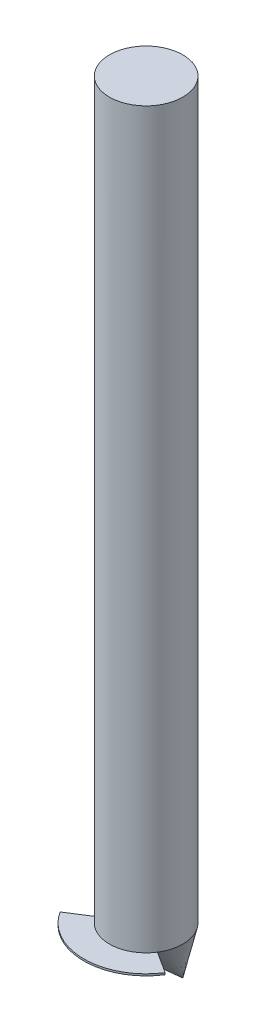
ISO-10303-21;
HEADER;
FILE_DESCRIPTION(('STEP AP214'),'2;1');
FILE_NAME('part.step','',(''),(''),'','','');
FILE_SCHEMA(('AUTOMOTIVE_DESIGN { 1 0 10303 214 1 1 1 1 }'));
ENDSEC;
DATA;
#1=APPLICATION_CONTEXT('core data for automotive mechanical design processes');
#2=APPLICATION_PROTOCOL_DEFINITION('international standard','automotive_design',2000,#1);
#3=PRODUCT_CONTEXT('',#1,'mechanical');
#4=PRODUCT('Part','Part','',(#3));
#5=PRODUCT_RELATED_PRODUCT_CATEGORY('part','',(#4));
#6=PRODUCT_DEFINITION_FORMATION('','',#4);
#7=PRODUCT_DEFINITION_CONTEXT('part definition',#1,'design');
#8=PRODUCT_DEFINITION('design','',#6,#7);
#9=PRODUCT_DEFINITION_SHAPE('','',#8);
#10=(LENGTH_UNIT() NAMED_UNIT(*) SI_UNIT(.MILLI.,.METRE.));
#11=(NAMED_UNIT(*) PLANE_ANGLE_UNIT() SI_UNIT($,.RADIAN.));
#12=(NAMED_UNIT(*) SI_UNIT($,.STERADIAN.) SOLID_ANGLE_UNIT());
#13=UNCERTAINTY_MEASURE_WITH_UNIT(LENGTH_MEASURE(1.E-05),#10,'distance_accuracy_value','');
#14=(GEOMETRIC_REPRESENTATION_CONTEXT(3) GLOBAL_UNCERTAINTY_ASSIGNED_CONTEXT((#13)) GLOBAL_UNIT_ASSIGNED_CONTEXT((#10,
#11,#12)) REPRESENTATION_CONTEXT('',''));
#15=CARTESIAN_POINT('',(0.,0.,0.));
#16=DIRECTION('',(0.,0.,1.));
#17=DIRECTION('',(1.,0.,0.));
#18=AXIS2_PLACEMENT_3D('',#15,#16,#17);
#19=CARTESIAN_POINT('',(0.,0.,0.));
#20=DIRECTION('',(0.,-1.,0.));
#21=DIRECTION('',(0.,0.,-1.));
#22=AXIS2_PLACEMENT_3D('',#19,#20,#21);
#23=PLANE('',#22);
#24=CARTESIAN_POINT('',(0.,0.,0.));
#25=DIRECTION('',(0.,1.,0.));
#26=DIRECTION('',(0.,0.,1.));
#27=AXIS2_PLACEMENT_3D('',#24,#25,#26);
#28=CIRCLE('',#27,5.);
#29=CARTESIAN_POINT('',(-4.21695722906443,0.,2.68649804173411));
#30=VERTEX_POINT('',#29);
#31=CARTESIAN_POINT('',(4.21696325108084,0.,2.68650190709249));
#32=VERTEX_POINT('',#31);
#33=EDGE_CURVE('E12',#30,#32,#28,.T.);
#34=ORIENTED_EDGE('',*,*,#33,.F.);
#35=DIRECTION('',(-0.843391445812887,0.,0.537299608346822));
#36=VECTOR('',#35,1.);
#37=CARTESIAN_POINT('',(0.,0.,0.));
#38=LINE('',#37,#36);
#39=CARTESIAN_POINT('',(-7.16882728940954,0.,4.56704667094799));
#40=VERTEX_POINT('',#39);
#41=EDGE_CURVE('E185',#30,#40,#38,.T.);
#42=ORIENTED_EDGE('',*,*,#41,.T.);
#43=CARTESIAN_POINT('',(0.,0.,0.));
#44=DIRECTION('',(0.,-1.,0.));
#45=DIRECTION('',(0.,0.,-1.));
#46=AXIS2_PLACEMENT_3D('',#43,#44,#45);
#47=CIRCLE('',#46,8.5);
#48=CARTESIAN_POINT('',(7.16882728940954,0.,4.56704667094799));
#49=VERTEX_POINT('',#48);
#50=EDGE_CURVE('E64',#49,#40,#47,.T.);
#51=ORIENTED_EDGE('',*,*,#50,.F.);
#52=DIRECTION('',(0.843391445812887,0.,0.537299608346822));
#53=VECTOR('',#52,1.);
#54=CARTESIAN_POINT('',(0.,0.,0.));
#55=LINE('',#54,#53);
#56=EDGE_CURVE('E166',#32,#49,#55,.T.);
#57=ORIENTED_EDGE('',*,*,#56,.F.);
#58=EDGE_LOOP('',(#34,#42,#51,#57));
#59=FACE_BOUND('',#58,.T.);
#60=ADVANCED_FACE('F53',(#59),#23,.F.);
#61=CARTESIAN_POINT('',(0.,0.,0.));
#62=DIRECTION('',(0.,-1.,0.));
#63=DIRECTION('',(0.,0.,-1.));
#64=AXIS2_PLACEMENT_3D('',#61,#62,#63);
#65=CYLINDRICAL_SURFACE('',#64,8.5);
#66=CARTESIAN_POINT('',(0.,-0.250000000000001,0.));
#67=DIRECTION('',(0.,-1.,0.));
#68=DIRECTION('',(0.,0.,-1.));
#69=AXIS2_PLACEMENT_3D('',#66,#67,#68);
#70=CIRCLE('',#69,8.5);
#71=CARTESIAN_POINT('',(7.16882728940954,-0.250000000000001,4.56704667094799));
#72=VERTEX_POINT('',#71);
#73=CARTESIAN_POINT('',(-7.16882728940954,-0.250000000000001,4.56704667094799));
#74=VERTEX_POINT('',#73);
#75=EDGE_CURVE('E213',#72,#74,#70,.T.);
#76=ORIENTED_EDGE('',*,*,#75,.F.);
#77=DIRECTION('',(0.,-1.,0.));
#78=VECTOR('',#77,1.);
#79=CARTESIAN_POINT('',(7.16882728940954,0.,4.56704667094799));
#80=LINE('',#79,#78);
#81=EDGE_CURVE('E174',#49,#72,#80,.T.);
#82=ORIENTED_EDGE('',*,*,#81,.F.);
#83=ORIENTED_EDGE('',*,*,#50,.T.);
#84=DIRECTION('',(0.,-1.,0.));
#85=VECTOR('',#84,1.);
#86=CARTESIAN_POINT('',(-7.16882728940954,0.,4.56704667094799));
#87=LINE('',#86,#85);
#88=EDGE_CURVE('E167',#40,#74,#87,.T.);
#89=ORIENTED_EDGE('',*,*,#88,.T.);
#90=EDGE_LOOP('',(#76,#82,#83,#89));
#91=FACE_BOUND('',#90,.T.);
#92=ADVANCED_FACE('F55',(#91),#65,.T.);
#93=CARTESIAN_POINT('',(0.,-4.5,0.));
#94=DIRECTION('',(0.,1.,0.));
#95=DIRECTION('',(0.,0.,1.));
#96=AXIS2_PLACEMENT_3D('',#93,#94,#95);
#97=CONICAL_SURFACE('',#96,0.,1.10714871779409);
#98=CARTESIAN_POINT('',(0.115010179875413,-4.43181684468914,0.0732695652887457));
#99=CARTESIAN_POINT('',(0.0955702027556307,-4.44317958346797,0.0614832766915166));
#100=CARTESIAN_POINT('',(0.0762660325394554,-4.45454288246637,0.0494843352852782));
#101=CARTESIAN_POINT('',(0.0379293059143179,-4.47727060090231,0.0250611468547828));
#102=CARTESIAN_POINT('',(0.0188967495053557,-4.48863502033985,0.0126368998305258));
#103=CARTESIAN_POINT('',(0.,-4.49999999999696,-2.74053783139161E-12));
#104=B_SPLINE_CURVE_WITH_KNOTS('',3,(#98,#99,#100,#101,#102,#103),.UNSPECIFIED.,.F.,.F.,(4,2,4),
(0.,0.0762348432187777,0.152469686437555),.UNSPECIFIED.);
#105=CARTESIAN_POINT('',(0.115010179875413,-4.43181684468914,0.0732695652887457));
#106=VERTEX_POINT('',#105);
#107=CARTESIAN_POINT('',(0.,-4.49999999998898,0.));
#108=VERTEX_POINT('',#107);
#109=EDGE_CURVE('E196',#106,#108,#104,.T.);
#110=ORIENTED_EDGE('',*,*,#109,.F.);
#111=DIRECTION('',(0.754352241791778,0.447213595499958,0.480575379419003));
#112=VECTOR('',#111,1.);
#113=CARTESIAN_POINT('',(1.5181046024632,-3.6,0.96713929502428));
#114=LINE('',#113,#112);
#115=EDGE_CURVE('E80',#106,#72,#114,.T.);
#116=ORIENTED_EDGE('',*,*,#115,.T.);
#117=ORIENTED_EDGE('',*,*,#75,.T.);
#118=DIRECTION('',(-0.754352241791778,0.447213595499958,0.480575379419003));
#119=VECTOR('',#118,1.);
#120=CARTESIAN_POINT('',(-1.5181046024632,-3.6,0.96713929502428));
#121=LINE('',#120,#119);
#122=CARTESIAN_POINT('',(-0.115010179875397,-4.43181684468915,0.073269565288735));
#123=VERTEX_POINT('',#122);
#124=EDGE_CURVE('E157',#123,#74,#121,.T.);
#125=ORIENTED_EDGE('',*,*,#124,.F.);
#126=CARTESIAN_POINT('',(-0.115010179875343,-4.43181684468919,0.0732695652887012));
#127=CARTESIAN_POINT('',(-0.0955702027555733,-4.44317958346801,0.0614832766914791));
#128=CARTESIAN_POINT('',(-0.0762660325394097,-4.4545428824664,0.049484335285248));
#129=CARTESIAN_POINT('',(-0.0379293059142952,-4.47727060090232,0.0250611468547674));
#130=CARTESIAN_POINT('',(-0.0188967495053444,-4.48863502033985,0.012636899830518));
#131=CARTESIAN_POINT('',(0.,-4.49999999999696,-2.74053783139161E-12));
#132=B_SPLINE_CURVE_WITH_KNOTS('',3,(#126,#127,#128,#129,#130,#131),.UNSPECIFIED.,.F.,.F.,(4,2,
4),(0.,0.076234843218732,0.152469686437463),.UNSPECIFIED.);
#133=EDGE_CURVE('E57',#108,#123,#132,.F.);
#134=ORIENTED_EDGE('',*,*,#133,.F.);
#135=EDGE_LOOP('',(#110,#116,#117,#125,#134));
#136=FACE_BOUND('',#135,.T.);
#137=ADVANCED_FACE('F124',(#136),#97,.T.);
#138=CARTESIAN_POINT('',(0.,0.,0.));
#139=DIRECTION('',(0.537299608346822,0.,-0.843391445812887));
#140=DIRECTION('',(-0.843391445812887,0.,-0.537299608346822));
#141=AXIS2_PLACEMENT_3D('',#138,#139,#140);
#142=PLANE('',#141);
#143=CARTESIAN_POINT('',(4.21695464372675,0.,2.68649639469236));
#144=CARTESIAN_POINT('',(4.13529598131993,-0.113362311672921,2.63447408933566));
#145=CARTESIAN_POINT('',(4.05322897952794,-0.22631300640358,2.58219164310034));
#146=CARTESIAN_POINT('',(3.8881825550377,-0.451304027508447,2.477045474405));
#147=CARTESIAN_POINT('',(3.80520299163304,-0.563344208726185,2.4241816623051));
#148=CARTESIAN_POINT('',(3.63825699057637,-0.786397157383103,2.31782532987116));
#149=CARTESIAN_POINT('',(3.55429050342816,-0.897409872789431,2.26433277800456));
#150=CARTESIAN_POINT('',(3.38482881952689,-1.11886008354666,2.1563737788447));
#151=CARTESIAN_POINT('',(3.29932787490589,-1.22929140000243,2.10190366975572));
#152=CARTESIAN_POINT('',(3.12712690414394,-1.44882508552312,1.9921995524011));
#153=CARTESIAN_POINT('',(3.04042692528829,-1.55792750667722,1.93696557425953));
#154=CARTESIAN_POINT('',(2.86569623854587,-1.77462393018895,1.82564985008546));
#155=CARTESIAN_POINT('',(2.77766553870195,-1.8822179416558,1.76956810917683));
#156=CARTESIAN_POINT('',(2.58926961889569,-2.10874306167403,1.64954667141079));
#157=CARTESIAN_POINT('',(2.48871295284673,-2.22745078792119,1.58548500994503));
#158=CARTESIAN_POINT('',(2.28548704113904,-2.46229511100159,1.4560158253706));
#159=CARTESIAN_POINT('',(2.18281785873475,-2.57843178460355,1.39060834255944));
#160=CARTESIAN_POINT('',(1.97530512805198,-2.80732032925812,1.25840815310241));
#161=CARTESIAN_POINT('',(1.87046768240539,-2.92007996256261,1.19161933426182));
#162=CARTESIAN_POINT('',(1.65806041764115,-3.14190869449309,1.05630098270138));
#163=CARTESIAN_POINT('',(1.55049093096159,-3.25097823840273,0.98777166176794));
#164=CARTESIAN_POINT('',(1.3670415254597,-3.43034244540092,0.870901501159707));
#165=CARTESIAN_POINT('',(1.29202836490579,-3.50188277502742,0.823112847401323));
#166=CARTESIAN_POINT('',(1.14036820372748,-3.64245974180417,0.726494668965118));
#167=CARTESIAN_POINT('',(1.06372147959544,-3.71149679739131,0.677665320432369));
#168=CARTESIAN_POINT('',(0.908642316753047,-3.84660691703344,0.578868997714616));
#169=CARTESIAN_POINT('',(0.830210819771741,-3.91268149196005,0.528902623477189));
#170=CARTESIAN_POINT('',(0.71080105481019,-4.00929157045482,0.452830213370164));
#171=CARTESIAN_POINT('',(0.67058962162996,-4.04116317110716,0.427212705146594));
#172=CARTESIAN_POINT('',(0.589639526772942,-4.10395476914346,0.375641807103644));
#173=CARTESIAN_POINT('',(0.548900853638491,-4.1348747457978,0.349688409984928));
#174=CARTESIAN_POINT('',(0.466840968728141,-4.19566640649007,0.297410497703258));
#175=CARTESIAN_POINT('',(0.425519469936641,-4.22553754682437,0.271085799691201));
#176=CARTESIAN_POINT('',(0.342266091629463,-4.2840547448849,0.218047548259942));
#177=CARTESIAN_POINT('',(0.300334249887229,-4.31270087799698,0.191334018905079));
#178=CARTESIAN_POINT('',(0.215725877275684,-4.36867365252226,0.137432540898944));
#179=CARTESIAN_POINT('',(0.173047907441461,-4.39599724311392,0.110243675525922));
#180=CARTESIAN_POINT('',(0.0870240078954488,-4.44914975994354,0.0554404074064665));
#181=CARTESIAN_POINT('',(0.0436779392865701,-4.47497836992081,0.0278259161728282));
#182=CARTESIAN_POINT('',(0.,-4.49999999998898,0.));
#183=B_SPLINE_CURVE_WITH_KNOTS('',3,(#143,#144,#145,#146,#147,#148,#149,#150,#151,#152,#153,
#154,#155,#156,#157,#158,#159,#160,#161,#162,#163,#164,#165,#166,#167,#168,#169,#170,#171,#172,
#173,#174,#175,#176,#177,#178,#179,#180,#181,#182),.UNSPECIFIED.,.F.,.F.,(4,2,2,2,2,2,2,2,2,2,2,
2,2,2,2,2,2,2,2,4),(0.,0.447247075529468,0.894564106166201,1.34190366719719,1.79161716043059,
2.24131296898443,2.69100606067202,3.19571445692332,3.70040776277318,4.20383463604227,
4.7072005424557,5.04959367760109,5.3919293133861,5.7340883236835,5.90612841205311,
6.07817224539365,6.25030398552431,6.42242511753058,6.59492602235503,6.76746328708282),.UNSPECIFIED.);
#184=EDGE_CURVE('E257',#32,#106,#183,.T.);
#185=ORIENTED_EDGE('',*,*,#184,.F.);
#186=ORIENTED_EDGE('',*,*,#56,.T.);
#187=ORIENTED_EDGE('',*,*,#81,.T.);
#188=ORIENTED_EDGE('',*,*,#115,.F.);
#189=EDGE_LOOP('',(#185,#186,#187,#188));
#190=FACE_BOUND('',#189,.T.);
#191=ADVANCED_FACE('F127',(#190),#142,.T.);
#192=CARTESIAN_POINT('',(0.,0.,0.));
#193=DIRECTION('',(0.537299608346822,0.,0.843391445812887));
#194=DIRECTION('',(0.843391445812887,0.,-0.537299608346822));
#195=AXIS2_PLACEMENT_3D('',#192,#193,#194);
#196=PLANE('',#195);
#197=ORIENTED_EDGE('',*,*,#41,.F.);
#198=CARTESIAN_POINT('',(-4.21695464372675,0.,2.68649639469236));
#199=CARTESIAN_POINT('',(-4.13529598131993,-0.113362311672921,2.63447408933566));
#200=CARTESIAN_POINT('',(-4.05322897952794,-0.226313006403581,2.58219164310034));
#201=CARTESIAN_POINT('',(-3.8881825550377,-0.451304027508452,2.477045474405));
#202=CARTESIAN_POINT('',(-3.80520299163304,-0.563344208726191,2.4241816623051));
#203=CARTESIAN_POINT('',(-3.63825699057637,-0.786397157383113,2.31782532987116));
#204=CARTESIAN_POINT('',(-3.55429050342815,-0.897409872789442,2.26433277800456));
#205=CARTESIAN_POINT('',(-3.38482881952688,-1.11886008354667,2.1563737788447));
#206=CARTESIAN_POINT('',(-3.29932787490587,-1.22929140000245,2.10190366975571));
#207=CARTESIAN_POINT('',(-3.12712690414393,-1.44882508552314,1.99219955240109));
#208=CARTESIAN_POINT('',(-3.04042692528828,-1.55792750667724,1.93696557425952));
#209=CARTESIAN_POINT('',(-2.86569623854586,-1.77462393018897,1.82564985008545));
#210=CARTESIAN_POINT('',(-2.77766553870193,-1.88221794165583,1.76956810917682));
#211=CARTESIAN_POINT('',(-2.58926961889567,-2.10874306167406,1.64954667141077));
#212=CARTESIAN_POINT('',(-2.48871295284671,-2.22745078792121,1.58548500994502));
#213=CARTESIAN_POINT('',(-2.28548704113902,-2.46229511100161,1.45601582537059));
#214=CARTESIAN_POINT('',(-2.18281785873473,-2.57843178460357,1.39060834255942));
#215=CARTESIAN_POINT('',(-1.97530512805197,-2.80732032925813,1.2584081531024));
#216=CARTESIAN_POINT('',(-1.87046768240538,-2.92007996256263,1.19161933426182));
#217=CARTESIAN_POINT('',(-1.65806041764114,-3.14190869449311,1.05630098270137));
#218=CARTESIAN_POINT('',(-1.55049093096158,-3.25097823840274,0.987771661767932));
#219=CARTESIAN_POINT('',(-1.36704152545969,-3.43034244540093,0.8709015011597));
#220=CARTESIAN_POINT('',(-1.29202836490578,-3.50188277502742,0.823112847401317));
#221=CARTESIAN_POINT('',(-1.14036820372747,-3.64245974180418,0.726494668965113));
#222=CARTESIAN_POINT('',(-1.06372147959544,-3.71149679739132,0.677665320432364));
#223=CARTESIAN_POINT('',(-0.90864231675304,-3.84660691703344,0.578868997714611));
#224=CARTESIAN_POINT('',(-0.830210819771735,-3.91268149196006,0.528902623477185));
#225=CARTESIAN_POINT('',(-0.710801054810185,-4.00929157045482,0.452830213370161));
#226=CARTESIAN_POINT('',(-0.670589621629956,-4.04116317110717,0.427212705146591));
#227=CARTESIAN_POINT('',(-0.589639526772938,-4.10395476914346,0.375641807103641));
#228=CARTESIAN_POINT('',(-0.548900853638488,-4.1348747457978,0.349688409984925));
#229=CARTESIAN_POINT('',(-0.466840968728138,-4.19566640649007,0.297410497703256));
#230=CARTESIAN_POINT('',(-0.425519469936638,-4.22553754682438,0.271085799691199));
#231=CARTESIAN_POINT('',(-0.34226609162946,-4.2840547448849,0.21804754825994));
#232=CARTESIAN_POINT('',(-0.300334249887227,-4.31270087799699,0.191334018905078));
#233=CARTESIAN_POINT('',(-0.215725877275682,-4.36867365252226,0.137432540898943));
#234=CARTESIAN_POINT('',(-0.173047907441459,-4.39599724311392,0.110243675525921));
#235=CARTESIAN_POINT('',(-0.0870240078954479,-4.44914975994354,0.0554404074064659));
#236=CARTESIAN_POINT('',(-0.0436779392865695,-4.47497836992081,0.0278259161728278));
#237=CARTESIAN_POINT('',(0.,-4.49999999998898,0.));
#238=B_SPLINE_CURVE_WITH_KNOTS('',3,(#198,#199,#200,#201,#202,#203,#204,#205,#206,#207,#208,
#209,#210,#211,#212,#213,#214,#215,#216,#217,#218,#219,#220,#221,#222,#223,#224,#225,#226,#227,
#228,#229,#230,#231,#232,#233,#234,#235,#236,#237),.UNSPECIFIED.,.F.,.F.,(4,2,2,2,2,2,2,2,2,2,2,
2,2,2,2,2,2,2,2,4),(0.,0.447247075529473,0.894564106166213,1.34190366719721,1.79161716043061,
2.24131296898446,2.69100606067206,3.19571445692335,3.7004077627732,4.20383463604229,
4.70720054245571,5.0495936776011,5.39192931338611,5.7340883236835,5.90612841205312,
6.07817224539365,6.25030398552431,6.42242511753058,6.59492602235503,6.76746328708282),.UNSPECIFIED.);
#239=EDGE_CURVE('E72',#30,#123,#238,.T.);
#240=ORIENTED_EDGE('',*,*,#239,.T.);
#241=ORIENTED_EDGE('',*,*,#124,.T.);
#242=ORIENTED_EDGE('',*,*,#88,.F.);
#243=EDGE_LOOP('',(#197,#240,#241,#242));
#244=FACE_BOUND('',#243,.T.);
#245=ADVANCED_FACE('F208',(#244),#196,.F.);
#246=CARTESIAN_POINT('',(0.,100.,0.));
#247=DIRECTION('',(0.,-1.,0.));
#248=DIRECTION('',(0.,0.,-1.));
#249=AXIS2_PLACEMENT_3D('',#246,#247,#248);
#250=CYLINDRICAL_SURFACE('',#249,5.);
#251=CARTESIAN_POINT('',(0.,100.,0.));
#252=DIRECTION('',(0.,1.,0.));
#253=DIRECTION('',(0.,0.,1.));
#254=AXIS2_PLACEMENT_3D('',#251,#252,#253);
#255=CIRCLE('',#254,5.);
#256=CARTESIAN_POINT('',(0.,100.,5.));
#257=VERTEX_POINT('',#256);
#258=EDGE_CURVE('E181',#257,#257,#255,.T.);
#259=ORIENTED_EDGE('',*,*,#258,.F.);
#260=EDGE_LOOP('',(#259));
#261=FACE_BOUND('',#260,.T.);
#262=CARTESIAN_POINT('',(0.,0.,5.));
#263=CARTESIAN_POINT('',(-0.326978984574362,0.,5.));
#264=CARTESIAN_POINT('',(-0.704611122936241,0.,4.97038895966088));
#265=CARTESIAN_POINT('',(-1.35974664688627,0.,4.81678314516054));
#266=CARTESIAN_POINT('',(-1.59277804522613,0.,4.74690177037475));
#267=CARTESIAN_POINT('',(-2.08490842149666,0.,4.55227143225375));
#268=CARTESIAN_POINT('',(-2.34418413499809,0.,4.42746620441345));
#269=CARTESIAN_POINT('',(-2.87722129558654,0.,4.10112836500192));
#270=CARTESIAN_POINT('',(-3.15118763253575,0.,3.89937128936302));
#271=CARTESIAN_POINT('',(-3.68749474470446,0.,3.39668403822491));
#272=CARTESIAN_POINT('',(-3.94989673329104,0.,3.09526722548789));
#273=CARTESIAN_POINT('',(-4.41758137591639,0.,2.38061718636143));
#274=CARTESIAN_POINT('',(-4.6224402239894,0.,1.96675194442517));
#275=CARTESIAN_POINT('',(-4.91419196510363,0.,1.04200967623448));
#276=CARTESIAN_POINT('',(-5.,0.,0.530954952157263));
#277=CARTESIAN_POINT('',(-5.,0.,-0.530954952157263));
#278=CARTESIAN_POINT('',(-4.91419196510363,0.,-1.04200967623448));
#279=CARTESIAN_POINT('',(-4.6224402239894,0.,-1.96675194442517));
#280=CARTESIAN_POINT('',(-4.41758137591639,0.,-2.38061718636143));
#281=CARTESIAN_POINT('',(-3.94989673329104,0.,-3.09526722548789));
#282=CARTESIAN_POINT('',(-3.68749474470446,0.,-3.39668403822491));
#283=CARTESIAN_POINT('',(-3.15118763253575,0.,-3.89937128936302));
#284=CARTESIAN_POINT('',(-2.87722129558654,0.,-4.10112836500192));
#285=CARTESIAN_POINT('',(-2.34418413499809,0.,-4.42746620441345));
#286=CARTESIAN_POINT('',(-2.08490842149666,0.,-4.55227143225375));
#287=CARTESIAN_POINT('',(-1.59277804522613,0.,-4.74690177037475));
#288=CARTESIAN_POINT('',(-1.35974664688627,0.,-4.81678314516054));
#289=CARTESIAN_POINT('',(-0.704611122936241,0.,-4.97038895966089));
#290=CARTESIAN_POINT('',(-0.326978984574363,0.,-5.));
#291=CARTESIAN_POINT('',(0.326978984574363,0.,-5.));
#292=CARTESIAN_POINT('',(0.704611122936243,0.,-4.97038895966088));
#293=CARTESIAN_POINT('',(1.35974664688627,0.,-4.81678314516054));
#294=CARTESIAN_POINT('',(1.59277804522613,0.,-4.74690177037475));
#295=CARTESIAN_POINT('',(2.08490842149666,0.,-4.55227143225375));
#296=CARTESIAN_POINT('',(2.34418413499808,0.,-4.42746620441345));
#297=CARTESIAN_POINT('',(2.87722129558655,0.,-4.10112836500191));
#298=CARTESIAN_POINT('',(3.15118763253575,0.,-3.89937128936302));
#299=CARTESIAN_POINT('',(3.68749474470446,0.,-3.39668403822491));
#300=CARTESIAN_POINT('',(3.94989673329104,0.,-3.09526722548789));
#301=CARTESIAN_POINT('',(4.41758137591639,0.,-2.38061718636143));
#302=CARTESIAN_POINT('',(4.6224402239894,0.,-1.96675194442517));
#303=CARTESIAN_POINT('',(4.91419196510363,0.,-1.04200967623448));
#304=CARTESIAN_POINT('',(5.,0.,-0.530954952157262));
#305=CARTESIAN_POINT('',(5.,0.,0.530954952157264));
#306=CARTESIAN_POINT('',(4.91419196510363,0.,1.04200967623448));
#307=CARTESIAN_POINT('',(4.6224402239894,0.,1.96675194442517));
#308=CARTESIAN_POINT('',(4.41758137591639,0.,2.38061718636143));
#309=CARTESIAN_POINT('',(3.94989673329104,0.,3.09526722548789));
#310=CARTESIAN_POINT('',(3.68749474470446,0.,3.39668403822491));
#311=CARTESIAN_POINT('',(3.15118763253575,0.,3.89937128936302));
#312=CARTESIAN_POINT('',(2.87722129558655,0.,4.10112836500192));
#313=CARTESIAN_POINT('',(2.34418413499808,0.,4.42746620441346));
#314=CARTESIAN_POINT('',(2.08490842149666,0.,4.55227143225375));
#315=CARTESIAN_POINT('',(1.59277804522613,0.,4.74690177037475));
#316=CARTESIAN_POINT('',(1.35974664688627,0.,4.81678314516054));
#317=CARTESIAN_POINT('',(0.704611122936242,0.,4.97038895966088));
#318=CARTESIAN_POINT('',(0.326978984574362,0.,5.));
#319=CARTESIAN_POINT('',(0.,0.,5.));
#320=B_SPLINE_CURVE_WITH_KNOTS('',3,(#262,#263,#264,#265,#266,#267,#268,#269,#270,#271,#272,
#273,#274,#275,#276,#277,#278,#279,#280,#281,#282,#283,#284,#285,#286,#287,#288,#289,#290,#291,
#292,#293,#294,#295,#296,#297,#298,#299,#300,#301,#302,#303,#304,#305,#306,#307,#308,#309,#310,
#311,#312,#313,#314,#315,#316,#317,#318,#319),.UNSPECIFIED.,.T.,.F.,(4,2,2,2,2,2,2,2,2,2,2,2,2,
2,2,2,2,2,2,2,2,2,2,2,2,2,2,2,4),(0.,0.0624999999999998,0.0937499999999998,0.125,0.15625,0.1875,
0.21875,0.25,0.28125,0.3125,0.34375,0.375,0.40625,0.4375,0.5,0.5625,0.59375,0.625,0.65625,
0.6875,0.71875,0.75,0.78125,0.8125,0.84375,0.875,0.90625,0.9375,1.),.UNSPECIFIED.);
#321=EDGE_CURVE('E186',#32,#30,#320,.F.);
#322=ORIENTED_EDGE('',*,*,#321,.T.);
#323=ORIENTED_EDGE('',*,*,#33,.T.);
#324=EDGE_LOOP('',(#322,#323));
#325=FACE_BOUND('',#324,.T.);
#326=ADVANCED_FACE('F111',(#261,#325),#250,.T.);
#327=CARTESIAN_POINT('',(0.,100.,0.));
#328=DIRECTION('',(0.,1.,0.));
#329=DIRECTION('',(0.,0.,1.));
#330=AXIS2_PLACEMENT_3D('',#327,#328,#329);
#331=PLANE('',#330);
#332=ORIENTED_EDGE('',*,*,#258,.T.);
#333=EDGE_LOOP('',(#332));
#334=FACE_BOUND('',#333,.T.);
#335=ADVANCED_FACE('F106',(#334),#331,.T.);
#336=CARTESIAN_POINT('',(0.,-9.,-5.00000000002449));
#337=CARTESIAN_POINT('',(0.,0.,5.));
#338=CARTESIAN_POINT('',(0.,-9.,-5.00000000002449));
#339=CARTESIAN_POINT('',(0.326978984574362,0.,5.));
#340=CARTESIAN_POINT('',(0.,-9.,-5.00000000002449));
#341=CARTESIAN_POINT('',(0.704611122936242,0.,4.97038895966088));
#342=CARTESIAN_POINT('',(0.,-9.,-5.00000000002449));
#343=CARTESIAN_POINT('',(1.35974664688627,0.,4.81678314516054));
#344=CARTESIAN_POINT('',(0.,-9.,-5.00000000002449));
#345=CARTESIAN_POINT('',(1.59277804522613,0.,4.74690177037475));
#346=CARTESIAN_POINT('',(0.,-9.,-5.00000000002449));
#347=CARTESIAN_POINT('',(2.08490842149666,0.,4.55227143225375));
#348=CARTESIAN_POINT('',(0.,-9.,-5.00000000002449));
#349=CARTESIAN_POINT('',(2.34418413499808,0.,4.42746620441346));
#350=CARTESIAN_POINT('',(0.,-9.,-5.00000000002449));
#351=CARTESIAN_POINT('',(2.87722129558655,0.,4.10112836500192));
#352=CARTESIAN_POINT('',(0.,-9.,-5.00000000002449));
#353=CARTESIAN_POINT('',(3.15118763253575,0.,3.89937128936302));
#354=CARTESIAN_POINT('',(0.,-9.,-5.00000000002449));
#355=CARTESIAN_POINT('',(3.68749474470446,0.,3.39668403822491));
#356=CARTESIAN_POINT('',(0.,-9.,-5.00000000002449));
#357=CARTESIAN_POINT('',(3.94989673329104,0.,3.09526722548789));
#358=CARTESIAN_POINT('',(0.,-9.,-5.00000000002449));
#359=CARTESIAN_POINT('',(4.41758137591639,0.,2.38061718636143));
#360=CARTESIAN_POINT('',(0.,-9.,-5.00000000002449));
#361=CARTESIAN_POINT('',(4.6224402239894,0.,1.96675194442517));
#362=CARTESIAN_POINT('',(0.,-9.,-5.00000000002449));
#363=CARTESIAN_POINT('',(4.91419196510363,0.,1.04200967623448));
#364=CARTESIAN_POINT('',(0.,-9.,-5.00000000002449));
#365=CARTESIAN_POINT('',(5.,0.,0.530954952157264));
#366=CARTESIAN_POINT('',(0.,-9.,-5.00000000002449));
#367=CARTESIAN_POINT('',(5.,0.,-0.530954952157262));
#368=CARTESIAN_POINT('',(0.,-9.,-5.00000000002449));
#369=CARTESIAN_POINT('',(4.91419196510363,0.,-1.04200967623448));
#370=CARTESIAN_POINT('',(0.,-9.,-5.00000000002449));
#371=CARTESIAN_POINT('',(4.6224402239894,0.,-1.96675194442517));
#372=CARTESIAN_POINT('',(0.,-9.,-5.00000000002449));
#373=CARTESIAN_POINT('',(4.41758137591639,0.,-2.38061718636143));
#374=CARTESIAN_POINT('',(0.,-9.,-5.00000000002449));
#375=CARTESIAN_POINT('',(3.94989673329104,0.,-3.09526722548789));
#376=CARTESIAN_POINT('',(0.,-9.,-5.00000000002449));
#377=CARTESIAN_POINT('',(3.68749474470446,0.,-3.39668403822491));
#378=CARTESIAN_POINT('',(0.,-9.,-5.00000000002449));
#379=CARTESIAN_POINT('',(3.15118763253575,0.,-3.89937128936302));
#380=CARTESIAN_POINT('',(0.,-9.,-5.00000000002449));
#381=CARTESIAN_POINT('',(2.87722129558655,0.,-4.10112836500191));
#382=CARTESIAN_POINT('',(0.,-9.,-5.00000000002449));
#383=CARTESIAN_POINT('',(2.34418413499808,0.,-4.42746620441345));
#384=CARTESIAN_POINT('',(0.,-9.,-5.00000000002449));
#385=CARTESIAN_POINT('',(2.08490842149666,0.,-4.55227143225375));
#386=CARTESIAN_POINT('',(0.,-9.,-5.00000000002449));
#387=CARTESIAN_POINT('',(1.59277804522613,0.,-4.74690177037475));
#388=CARTESIAN_POINT('',(0.,-9.,-5.00000000002449));
#389=CARTESIAN_POINT('',(1.35974664688627,0.,-4.81678314516054));
#390=CARTESIAN_POINT('',(0.,-9.,-5.00000000002449));
#391=CARTESIAN_POINT('',(0.704611122936243,0.,-4.97038895966088));
#392=CARTESIAN_POINT('',(0.,-9.,-5.00000000002449));
#393=CARTESIAN_POINT('',(0.326978984574363,0.,-5.));
#394=CARTESIAN_POINT('',(0.,-9.,-5.00000000002449));
#395=CARTESIAN_POINT('',(-0.326978984574363,0.,-5.));
#396=CARTESIAN_POINT('',(0.,-9.,-5.00000000002449));
#397=CARTESIAN_POINT('',(-0.704611122936241,0.,-4.97038895966089));
#398=CARTESIAN_POINT('',(0.,-9.,-5.00000000002449));
#399=CARTESIAN_POINT('',(-1.35974664688627,0.,-4.81678314516054));
#400=CARTESIAN_POINT('',(0.,-9.,-5.00000000002449));
#401=CARTESIAN_POINT('',(-1.59277804522613,0.,-4.74690177037475));
#402=CARTESIAN_POINT('',(0.,-9.,-5.00000000002449));
#403=CARTESIAN_POINT('',(-2.08490842149666,0.,-4.55227143225375));
#404=CARTESIAN_POINT('',(0.,-9.,-5.00000000002449));
#405=CARTESIAN_POINT('',(-2.34418413499809,0.,-4.42746620441345));
#406=CARTESIAN_POINT('',(0.,-9.,-5.00000000002449));
#407=CARTESIAN_POINT('',(-2.87722129558654,0.,-4.10112836500192));
#408=CARTESIAN_POINT('',(0.,-9.,-5.00000000002449));
#409=CARTESIAN_POINT('',(-3.15118763253575,0.,-3.89937128936302));
#410=CARTESIAN_POINT('',(0.,-9.,-5.00000000002449));
#411=CARTESIAN_POINT('',(-3.68749474470446,0.,-3.39668403822491));
#412=CARTESIAN_POINT('',(0.,-9.,-5.00000000002449));
#413=CARTESIAN_POINT('',(-3.94989673329104,0.,-3.09526722548789));
#414=CARTESIAN_POINT('',(0.,-9.,-5.00000000002449));
#415=CARTESIAN_POINT('',(-4.41758137591639,0.,-2.38061718636143));
#416=CARTESIAN_POINT('',(0.,-9.,-5.00000000002449));
#417=CARTESIAN_POINT('',(-4.6224402239894,0.,-1.96675194442517));
#418=CARTESIAN_POINT('',(0.,-9.,-5.00000000002449));
#419=CARTESIAN_POINT('',(-4.91419196510363,0.,-1.04200967623448));
#420=CARTESIAN_POINT('',(0.,-9.,-5.00000000002449));
#421=CARTESIAN_POINT('',(-5.,0.,-0.530954952157263));
#422=CARTESIAN_POINT('',(0.,-9.,-5.00000000002449));
#423=CARTESIAN_POINT('',(-5.,0.,0.530954952157263));
#424=CARTESIAN_POINT('',(0.,-9.,-5.00000000002449));
#425=CARTESIAN_POINT('',(-4.91419196510363,0.,1.04200967623448));
#426=CARTESIAN_POINT('',(0.,-9.,-5.00000000002449));
#427=CARTESIAN_POINT('',(-4.6224402239894,0.,1.96675194442517));
#428=CARTESIAN_POINT('',(0.,-9.,-5.00000000002449));
#429=CARTESIAN_POINT('',(-4.41758137591639,0.,2.38061718636143));
#430=CARTESIAN_POINT('',(0.,-9.,-5.00000000002449));
#431=CARTESIAN_POINT('',(-3.94989673329104,0.,3.09526722548789));
#432=CARTESIAN_POINT('',(0.,-9.,-5.00000000002449));
#433=CARTESIAN_POINT('',(-3.68749474470446,0.,3.39668403822491));
#434=CARTESIAN_POINT('',(0.,-9.,-5.00000000002449));
#435=CARTESIAN_POINT('',(-3.15118763253575,0.,3.89937128936302));
#436=CARTESIAN_POINT('',(0.,-9.,-5.00000000002449));
#437=CARTESIAN_POINT('',(-2.87722129558654,0.,4.10112836500192));
#438=CARTESIAN_POINT('',(0.,-9.,-5.00000000002449));
#439=CARTESIAN_POINT('',(-2.34418413499809,0.,4.42746620441345));
#440=CARTESIAN_POINT('',(0.,-9.,-5.00000000002449));
#441=CARTESIAN_POINT('',(-2.08490842149666,0.,4.55227143225375));
#442=CARTESIAN_POINT('',(0.,-9.,-5.00000000002449));
#443=CARTESIAN_POINT('',(-1.59277804522613,0.,4.74690177037475));
#444=CARTESIAN_POINT('',(0.,-9.,-5.00000000002449));
#445=CARTESIAN_POINT('',(-1.35974664688627,0.,4.81678314516054));
#446=CARTESIAN_POINT('',(0.,-9.,-5.00000000002449));
#447=CARTESIAN_POINT('',(-0.704611122936241,0.,4.97038895966088));
#448=CARTESIAN_POINT('',(0.,-9.,-5.00000000002449));
#449=CARTESIAN_POINT('',(-0.326978984574362,0.,5.));
#450=CARTESIAN_POINT('',(0.,-9.,-5.00000000002449));
#451=CARTESIAN_POINT('',(0.,0.,5.));
#452=B_SPLINE_SURFACE_WITH_KNOTS('',3,1,((#336,#337),(#338,#339),(#340,#341),(#342,#343),(#344,
#345),(#346,#347),(#348,#349),(#350,#351),(#352,#353),(#354,#355),(#356,#357),(#358,#359),(#360,
#361),(#362,#363),(#364,#365),(#366,#367),(#368,#369),(#370,#371),(#372,#373),(#374,#375),(#376,
#377),(#378,#379),(#380,#381),(#382,#383),(#384,#385),(#386,#387),(#388,#389),(#390,#391),(#392,
#393),(#394,#395),(#396,#397),(#398,#399),(#400,#401),(#402,#403),(#404,#405),(#406,#407),(#408,
#409),(#410,#411),(#412,#413),(#414,#415),(#416,#417),(#418,#419),(#420,#421),(#422,#423),(#424,
#425),(#426,#427),(#428,#429),(#430,#431),(#432,#433),(#434,#435),(#436,#437),(#438,#439),(#440,
#441),(#442,#443),(#444,#445),(#446,#447),(#448,#449),(#450,#451)),.UNSPECIFIED.,.T.,.F.,.F.,(4,
2,2,2,2,2,2,2,2,2,2,2,2,2,2,2,2,2,2,2,2,2,2,2,2,2,2,2,4),(2,2),(0.,0.0625,0.09375,0.125,0.15625,
0.1875,0.21875,0.25,0.28125,0.3125,0.34375,0.375,0.40625,0.4375,0.5,0.5625,0.59375,0.625,
0.65625,0.6875,0.71875,0.75,0.78125,0.8125,0.84375,0.875,0.90625,0.9375,1.),(0.,1.),.UNSPECIFIED.);
#453=ORIENTED_EDGE('',*,*,#321,.F.);
#454=ORIENTED_EDGE('',*,*,#184,.T.);
#455=ORIENTED_EDGE('',*,*,#109,.T.);
#456=ORIENTED_EDGE('',*,*,#133,.T.);
#457=ORIENTED_EDGE('',*,*,#239,.F.);
#458=EDGE_LOOP('',(#453,#454,#455,#456,#457));
#459=FACE_BOUND('',#458,.T.);
#460=CARTESIAN_POINT('',(0.,-9.,-5.00000000002449));
#461=VERTEX_POINT('',#460);
#462=VERTEX_LOOP('',#461);
#463=FACE_BOUND('',#462,.T.);
#464=ADVANCED_FACE('F104',(#459,#463),#452,.T.);
#465=CLOSED_SHELL('',(#60,#92,#137,#191,#245,#326,#335,#464));
#466=MANIFOLD_SOLID_BREP('B2',#465);
#467=ADVANCED_BREP_SHAPE_REPRESENTATION('',(#18,#466),#14);
#468=SHAPE_DEFINITION_REPRESENTATION(#9,#467);
ENDSEC;
END-ISO-10303-21;
